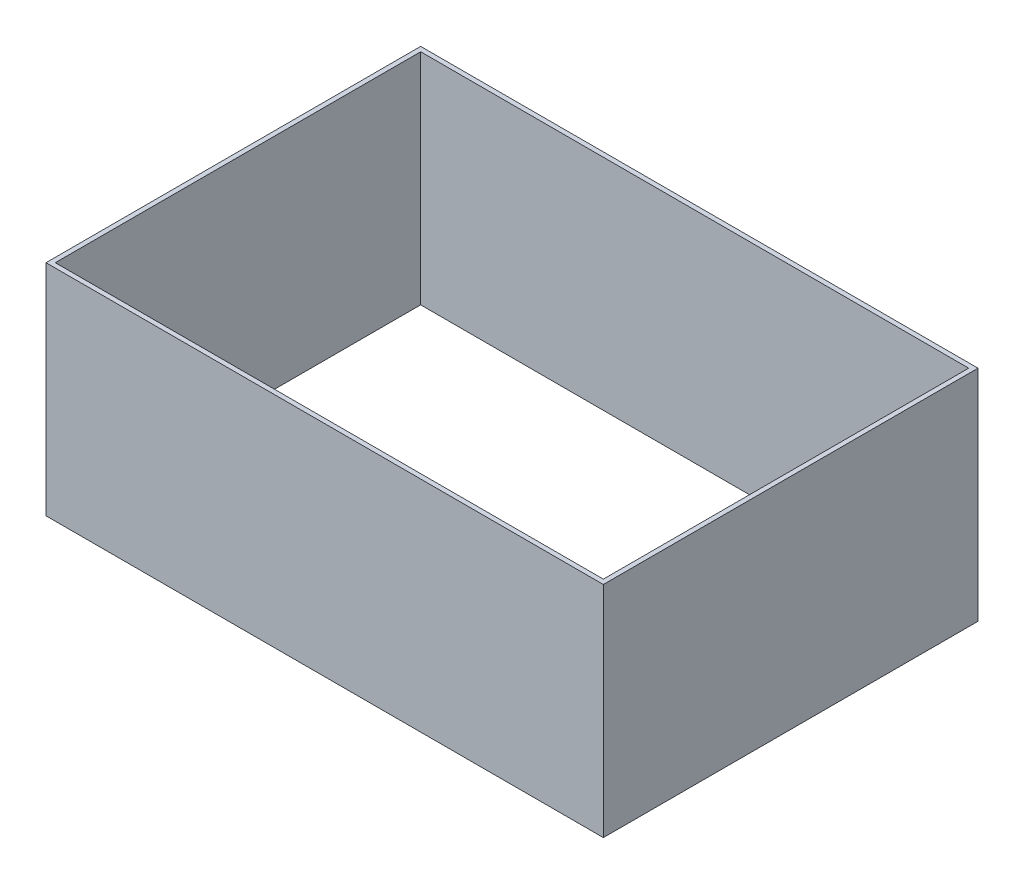
ISO-10303-21;
HEADER;
FILE_DESCRIPTION(('STEP AP214'),'2;1');
FILE_NAME('part.step','',(''),(''),'','','');
FILE_SCHEMA(('AUTOMOTIVE_DESIGN { 1 0 10303 214 1 1 1 1 }'));
ENDSEC;
DATA;
#1=APPLICATION_CONTEXT('core data for automotive mechanical design processes');
#2=APPLICATION_PROTOCOL_DEFINITION('international standard','automotive_design',2000,#1);
#3=PRODUCT_CONTEXT('',#1,'mechanical');
#4=PRODUCT('Part','Part','',(#3));
#5=PRODUCT_RELATED_PRODUCT_CATEGORY('part','',(#4));
#6=PRODUCT_DEFINITION_FORMATION('','',#4);
#7=PRODUCT_DEFINITION_CONTEXT('part definition',#1,'design');
#8=PRODUCT_DEFINITION('design','',#6,#7);
#9=PRODUCT_DEFINITION_SHAPE('','',#8);
#10=(LENGTH_UNIT() NAMED_UNIT(*) SI_UNIT(.MILLI.,.METRE.));
#11=(NAMED_UNIT(*) PLANE_ANGLE_UNIT() SI_UNIT($,.RADIAN.));
#12=(NAMED_UNIT(*) SI_UNIT($,.STERADIAN.) SOLID_ANGLE_UNIT());
#13=UNCERTAINTY_MEASURE_WITH_UNIT(LENGTH_MEASURE(1.E-05),#10,'distance_accuracy_value','');
#14=(GEOMETRIC_REPRESENTATION_CONTEXT(3) GLOBAL_UNCERTAINTY_ASSIGNED_CONTEXT((#13)) GLOBAL_UNIT_ASSIGNED_CONTEXT((#10,
#11,#12)) REPRESENTATION_CONTEXT('',''));
#15=CARTESIAN_POINT('',(0.,0.,0.));
#16=DIRECTION('',(0.,0.,1.));
#17=DIRECTION('',(1.,0.,0.));
#18=AXIS2_PLACEMENT_3D('',#15,#16,#17);
#19=CARTESIAN_POINT('',(0.,120.,0.));
#20=DIRECTION('',(0.,1.,0.));
#21=DIRECTION('',(0.,0.,1.));
#22=AXIS2_PLACEMENT_3D('',#19,#20,#21);
#23=PLANE('',#22);
#24=DIRECTION('',(0.,0.,1.));
#25=VECTOR('',#24,1.);
#26=CARTESIAN_POINT('',(-152.54,120.,-102.54));
#27=LINE('',#26,#25);
#28=CARTESIAN_POINT('',(-152.54,120.,-102.54));
#29=VERTEX_POINT('',#28);
#30=CARTESIAN_POINT('',(-152.54,120.,102.54));
#31=VERTEX_POINT('',#30);
#32=EDGE_CURVE('E134',#29,#31,#27,.T.);
#33=ORIENTED_EDGE('',*,*,#32,.T.);
#34=DIRECTION('',(1.,0.,0.));
#35=VECTOR('',#34,1.);
#36=CARTESIAN_POINT('',(-152.54,120.,102.54));
#37=LINE('',#36,#35);
#38=CARTESIAN_POINT('',(152.54,120.,102.54));
#39=VERTEX_POINT('',#38);
#40=EDGE_CURVE('E137',#31,#39,#37,.T.);
#41=ORIENTED_EDGE('',*,*,#40,.T.);
#42=DIRECTION('',(0.,0.,-1.));
#43=VECTOR('',#42,1.);
#44=CARTESIAN_POINT('',(152.54,120.,-102.54));
#45=LINE('',#44,#43);
#46=CARTESIAN_POINT('',(152.54,120.,-102.54));
#47=VERTEX_POINT('',#46);
#48=EDGE_CURVE('E140',#39,#47,#45,.T.);
#49=ORIENTED_EDGE('',*,*,#48,.T.);
#50=DIRECTION('',(-1.,0.,0.));
#51=VECTOR('',#50,1.);
#52=CARTESIAN_POINT('',(-152.54,120.,-102.54));
#53=LINE('',#52,#51);
#54=EDGE_CURVE('E142',#47,#29,#53,.T.);
#55=ORIENTED_EDGE('',*,*,#54,.T.);
#56=EDGE_LOOP('',(#33,#41,#49,#55));
#57=FACE_BOUND('',#56,.T.);
#58=DIRECTION('',(-1.,0.,0.));
#59=VECTOR('',#58,1.);
#60=CARTESIAN_POINT('',(-150.,120.,-100.));
#61=LINE('',#60,#59);
#62=CARTESIAN_POINT('',(150.,120.,-100.));
#63=VERTEX_POINT('',#62);
#64=CARTESIAN_POINT('',(-150.,120.,-100.));
#65=VERTEX_POINT('',#64);
#66=EDGE_CURVE('E106',#63,#65,#61,.T.);
#67=ORIENTED_EDGE('',*,*,#66,.F.);
#68=DIRECTION('',(0.,0.,-1.));
#69=VECTOR('',#68,1.);
#70=CARTESIAN_POINT('',(150.,120.,-100.));
#71=LINE('',#70,#69);
#72=CARTESIAN_POINT('',(150.,120.,100.));
#73=VERTEX_POINT('',#72);
#74=EDGE_CURVE('E98',#73,#63,#71,.T.);
#75=ORIENTED_EDGE('',*,*,#74,.F.);
#76=DIRECTION('',(1.,0.,0.));
#77=VECTOR('',#76,1.);
#78=CARTESIAN_POINT('',(-150.,120.,100.));
#79=LINE('',#78,#77);
#80=CARTESIAN_POINT('',(-150.,120.,100.));
#81=VERTEX_POINT('',#80);
#82=EDGE_CURVE('E120',#81,#73,#79,.T.);
#83=ORIENTED_EDGE('',*,*,#82,.F.);
#84=DIRECTION('',(0.,0.,1.));
#85=VECTOR('',#84,1.);
#86=CARTESIAN_POINT('',(-150.,120.,-100.));
#87=LINE('',#86,#85);
#88=EDGE_CURVE('E118',#65,#81,#87,.T.);
#89=ORIENTED_EDGE('',*,*,#88,.F.);
#90=EDGE_LOOP('',(#67,#75,#83,#89));
#91=FACE_BOUND('',#90,.T.);
#92=ADVANCED_FACE('F33',(#57,#91),#23,.T.);
#93=CARTESIAN_POINT('',(0.,0.,0.));
#94=DIRECTION('',(0.,1.,0.));
#95=DIRECTION('',(0.,0.,1.));
#96=AXIS2_PLACEMENT_3D('',#93,#94,#95);
#97=PLANE('',#96);
#98=DIRECTION('',(0.,0.,1.));
#99=VECTOR('',#98,1.);
#100=CARTESIAN_POINT('',(-152.54,0.,-102.54));
#101=LINE('',#100,#99);
#102=CARTESIAN_POINT('',(-152.54,0.,-102.54));
#103=VERTEX_POINT('',#102);
#104=CARTESIAN_POINT('',(-152.54,0.,102.54));
#105=VERTEX_POINT('',#104);
#106=EDGE_CURVE('E114',#103,#105,#101,.T.);
#107=ORIENTED_EDGE('',*,*,#106,.F.);
#108=DIRECTION('',(-1.,0.,0.));
#109=VECTOR('',#108,1.);
#110=CARTESIAN_POINT('',(-152.54,0.,-102.54));
#111=LINE('',#110,#109);
#112=CARTESIAN_POINT('',(152.54,0.,-102.54));
#113=VERTEX_POINT('',#112);
#114=EDGE_CURVE('E138',#113,#103,#111,.T.);
#115=ORIENTED_EDGE('',*,*,#114,.F.);
#116=DIRECTION('',(0.,0.,-1.));
#117=VECTOR('',#116,1.);
#118=CARTESIAN_POINT('',(152.54,0.,-102.54));
#119=LINE('',#118,#117);
#120=CARTESIAN_POINT('',(152.54,0.,102.54));
#121=VERTEX_POINT('',#120);
#122=EDGE_CURVE('E149',#121,#113,#119,.T.);
#123=ORIENTED_EDGE('',*,*,#122,.F.);
#124=DIRECTION('',(1.,0.,0.));
#125=VECTOR('',#124,1.);
#126=CARTESIAN_POINT('',(-152.54,0.,102.54));
#127=LINE('',#126,#125);
#128=EDGE_CURVE('E147',#105,#121,#127,.T.);
#129=ORIENTED_EDGE('',*,*,#128,.F.);
#130=EDGE_LOOP('',(#107,#115,#123,#129));
#131=FACE_BOUND('',#130,.T.);
#132=DIRECTION('',(0.,0.,-1.));
#133=VECTOR('',#132,1.);
#134=CARTESIAN_POINT('',(150.,0.,-100.));
#135=LINE('',#134,#133);
#136=CARTESIAN_POINT('',(150.,0.,100.));
#137=VERTEX_POINT('',#136);
#138=CARTESIAN_POINT('',(150.,0.,-100.));
#139=VERTEX_POINT('',#138);
#140=EDGE_CURVE('E56',#137,#139,#135,.T.);
#141=ORIENTED_EDGE('',*,*,#140,.T.);
#142=DIRECTION('',(-1.,0.,0.));
#143=VECTOR('',#142,1.);
#144=CARTESIAN_POINT('',(-150.,0.,-100.));
#145=LINE('',#144,#143);
#146=CARTESIAN_POINT('',(-150.,0.,-100.));
#147=VERTEX_POINT('',#146);
#148=EDGE_CURVE('E113',#139,#147,#145,.T.);
#149=ORIENTED_EDGE('',*,*,#148,.T.);
#150=DIRECTION('',(0.,0.,1.));
#151=VECTOR('',#150,1.);
#152=CARTESIAN_POINT('',(-150.,0.,-100.));
#153=LINE('',#152,#151);
#154=CARTESIAN_POINT('',(-150.,0.,100.));
#155=VERTEX_POINT('',#154);
#156=EDGE_CURVE('E126',#147,#155,#153,.T.);
#157=ORIENTED_EDGE('',*,*,#156,.T.);
#158=DIRECTION('',(1.,0.,0.));
#159=VECTOR('',#158,1.);
#160=CARTESIAN_POINT('',(-150.,0.,100.));
#161=LINE('',#160,#159);
#162=EDGE_CURVE('E107',#155,#137,#161,.T.);
#163=ORIENTED_EDGE('',*,*,#162,.T.);
#164=EDGE_LOOP('',(#141,#149,#157,#163));
#165=FACE_BOUND('',#164,.T.);
#166=ADVANCED_FACE('F167',(#131,#165),#97,.F.);
#167=CARTESIAN_POINT('',(-152.54,120.,-102.54));
#168=DIRECTION('',(1.,0.,0.));
#169=DIRECTION('',(0.,0.,-1.));
#170=AXIS2_PLACEMENT_3D('',#167,#168,#169);
#171=PLANE('',#170);
#172=ORIENTED_EDGE('',*,*,#106,.T.);
#173=DIRECTION('',(0.,-1.,0.));
#174=VECTOR('',#173,1.);
#175=CARTESIAN_POINT('',(-152.54,120.,102.54));
#176=LINE('',#175,#174);
#177=EDGE_CURVE('E11',#31,#105,#176,.T.);
#178=ORIENTED_EDGE('',*,*,#177,.F.);
#179=ORIENTED_EDGE('',*,*,#32,.F.);
#180=DIRECTION('',(0.,-1.,0.));
#181=VECTOR('',#180,1.);
#182=CARTESIAN_POINT('',(-152.54,120.,-102.54));
#183=LINE('',#182,#181);
#184=EDGE_CURVE('E144',#29,#103,#183,.T.);
#185=ORIENTED_EDGE('',*,*,#184,.T.);
#186=EDGE_LOOP('',(#172,#178,#179,#185));
#187=FACE_BOUND('',#186,.T.);
#188=ADVANCED_FACE('F35',(#187),#171,.F.);
#189=CARTESIAN_POINT('',(-152.54,120.,102.54));
#190=DIRECTION('',(0.,0.,-1.));
#191=DIRECTION('',(-1.,0.,0.));
#192=AXIS2_PLACEMENT_3D('',#189,#190,#191);
#193=PLANE('',#192);
#194=ORIENTED_EDGE('',*,*,#128,.T.);
#195=DIRECTION('',(0.,-1.,0.));
#196=VECTOR('',#195,1.);
#197=CARTESIAN_POINT('',(152.54,120.,102.54));
#198=LINE('',#197,#196);
#199=EDGE_CURVE('E41',#39,#121,#198,.T.);
#200=ORIENTED_EDGE('',*,*,#199,.F.);
#201=ORIENTED_EDGE('',*,*,#40,.F.);
#202=ORIENTED_EDGE('',*,*,#177,.T.);
#203=EDGE_LOOP('',(#194,#200,#201,#202));
#204=FACE_BOUND('',#203,.T.);
#205=ADVANCED_FACE('F177',(#204),#193,.F.);
#206=CARTESIAN_POINT('',(152.54,120.,-102.54));
#207=DIRECTION('',(-1.,0.,0.));
#208=DIRECTION('',(0.,0.,1.));
#209=AXIS2_PLACEMENT_3D('',#206,#207,#208);
#210=PLANE('',#209);
#211=ORIENTED_EDGE('',*,*,#122,.T.);
#212=DIRECTION('',(0.,-1.,0.));
#213=VECTOR('',#212,1.);
#214=CARTESIAN_POINT('',(152.54,120.,-102.54));
#215=LINE('',#214,#213);
#216=EDGE_CURVE('E154',#47,#113,#215,.T.);
#217=ORIENTED_EDGE('',*,*,#216,.F.);
#218=ORIENTED_EDGE('',*,*,#48,.F.);
#219=ORIENTED_EDGE('',*,*,#199,.T.);
#220=EDGE_LOOP('',(#211,#217,#218,#219));
#221=FACE_BOUND('',#220,.T.);
#222=ADVANCED_FACE('F161',(#221),#210,.F.);
#223=CARTESIAN_POINT('',(-152.54,120.,-102.54));
#224=DIRECTION('',(0.,0.,1.));
#225=DIRECTION('',(1.,0.,0.));
#226=AXIS2_PLACEMENT_3D('',#223,#224,#225);
#227=PLANE('',#226);
#228=ORIENTED_EDGE('',*,*,#114,.T.);
#229=ORIENTED_EDGE('',*,*,#184,.F.);
#230=ORIENTED_EDGE('',*,*,#54,.F.);
#231=ORIENTED_EDGE('',*,*,#216,.T.);
#232=EDGE_LOOP('',(#228,#229,#230,#231));
#233=FACE_BOUND('',#232,.T.);
#234=ADVANCED_FACE('F171',(#233),#227,.F.);
#235=CARTESIAN_POINT('',(150.,120.,-100.));
#236=DIRECTION('',(-1.,0.,0.));
#237=DIRECTION('',(0.,0.,1.));
#238=AXIS2_PLACEMENT_3D('',#235,#236,#237);
#239=PLANE('',#238);
#240=ORIENTED_EDGE('',*,*,#140,.F.);
#241=DIRECTION('',(0.,-1.,0.));
#242=VECTOR('',#241,1.);
#243=CARTESIAN_POINT('',(150.,120.,100.));
#244=LINE('',#243,#242);
#245=EDGE_CURVE('E102',#73,#137,#244,.T.);
#246=ORIENTED_EDGE('',*,*,#245,.F.);
#247=ORIENTED_EDGE('',*,*,#74,.T.);
#248=DIRECTION('',(0.,-1.,0.));
#249=VECTOR('',#248,1.);
#250=CARTESIAN_POINT('',(150.,120.,-100.));
#251=LINE('',#250,#249);
#252=EDGE_CURVE('E101',#63,#139,#251,.T.);
#253=ORIENTED_EDGE('',*,*,#252,.T.);
#254=EDGE_LOOP('',(#240,#246,#247,#253));
#255=FACE_BOUND('',#254,.T.);
#256=ADVANCED_FACE('F100',(#255),#239,.T.);
#257=CARTESIAN_POINT('',(-150.,120.,-100.));
#258=DIRECTION('',(0.,0.,1.));
#259=DIRECTION('',(1.,0.,0.));
#260=AXIS2_PLACEMENT_3D('',#257,#258,#259);
#261=PLANE('',#260);
#262=ORIENTED_EDGE('',*,*,#148,.F.);
#263=ORIENTED_EDGE('',*,*,#252,.F.);
#264=ORIENTED_EDGE('',*,*,#66,.T.);
#265=DIRECTION('',(0.,-1.,0.));
#266=VECTOR('',#265,1.);
#267=CARTESIAN_POINT('',(-150.,120.,-100.));
#268=LINE('',#267,#266);
#269=EDGE_CURVE('E115',#65,#147,#268,.T.);
#270=ORIENTED_EDGE('',*,*,#269,.T.);
#271=EDGE_LOOP('',(#262,#263,#264,#270));
#272=FACE_BOUND('',#271,.T.);
#273=ADVANCED_FACE('F110',(#272),#261,.T.);
#274=CARTESIAN_POINT('',(-150.,120.,-100.));
#275=DIRECTION('',(1.,0.,0.));
#276=DIRECTION('',(0.,0.,-1.));
#277=AXIS2_PLACEMENT_3D('',#274,#275,#276);
#278=PLANE('',#277);
#279=ORIENTED_EDGE('',*,*,#156,.F.);
#280=ORIENTED_EDGE('',*,*,#269,.F.);
#281=ORIENTED_EDGE('',*,*,#88,.T.);
#282=DIRECTION('',(0.,-1.,0.));
#283=VECTOR('',#282,1.);
#284=CARTESIAN_POINT('',(-150.,120.,100.));
#285=LINE('',#284,#283);
#286=EDGE_CURVE('E48',#81,#155,#285,.T.);
#287=ORIENTED_EDGE('',*,*,#286,.T.);
#288=EDGE_LOOP('',(#279,#280,#281,#287));
#289=FACE_BOUND('',#288,.T.);
#290=ADVANCED_FACE('F200',(#289),#278,.T.);
#291=CARTESIAN_POINT('',(-150.,120.,100.));
#292=DIRECTION('',(0.,0.,-1.));
#293=DIRECTION('',(-1.,0.,0.));
#294=AXIS2_PLACEMENT_3D('',#291,#292,#293);
#295=PLANE('',#294);
#296=ORIENTED_EDGE('',*,*,#162,.F.);
#297=ORIENTED_EDGE('',*,*,#286,.F.);
#298=ORIENTED_EDGE('',*,*,#82,.T.);
#299=ORIENTED_EDGE('',*,*,#245,.T.);
#300=EDGE_LOOP('',(#296,#297,#298,#299));
#301=FACE_BOUND('',#300,.T.);
#302=ADVANCED_FACE('F204',(#301),#295,.T.);
#303=CLOSED_SHELL('',(#92,#166,#188,#205,#222,#234,#256,#273,#290,#302));
#304=MANIFOLD_SOLID_BREP('B2',#303);
#305=ADVANCED_BREP_SHAPE_REPRESENTATION('',(#18,#304),#14);
#306=SHAPE_DEFINITION_REPRESENTATION(#9,#305);
ENDSEC;
END-ISO-10303-21;
